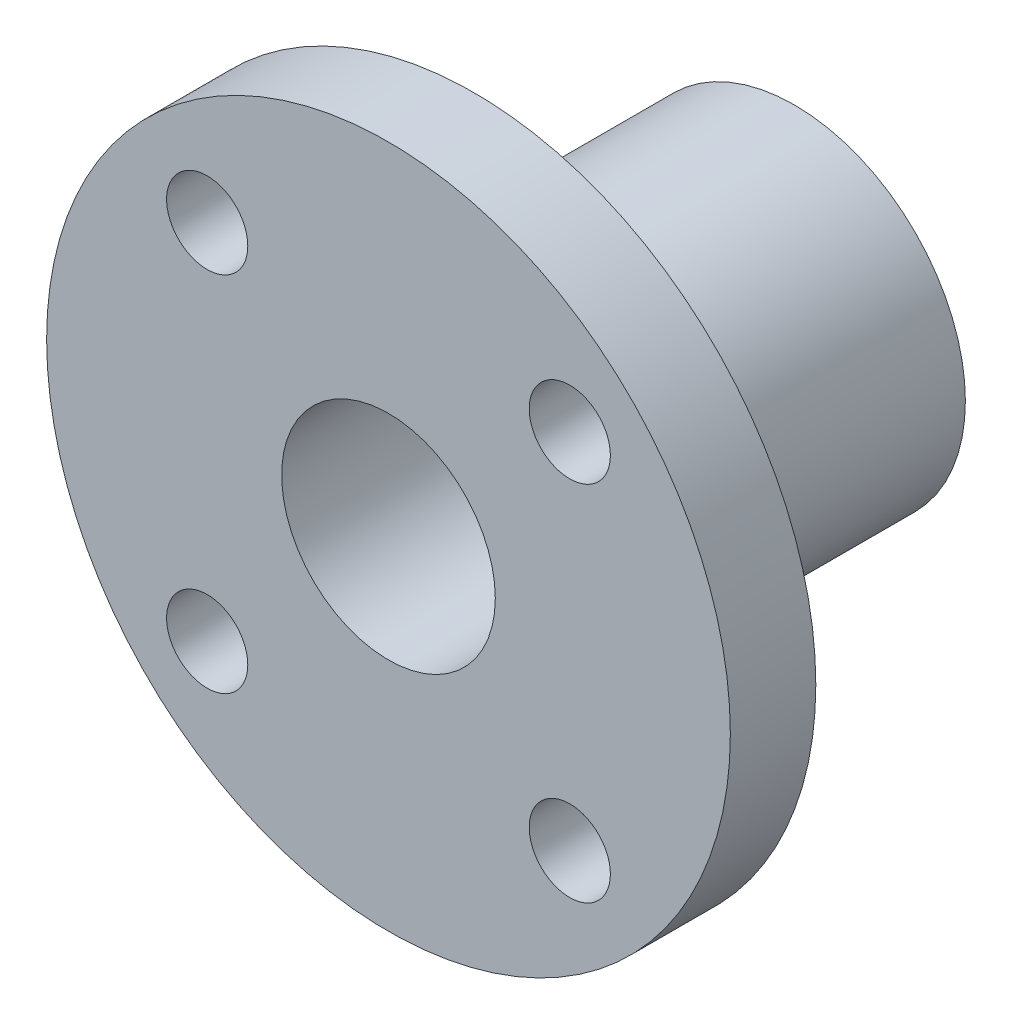
ISO-10303-21;
HEADER;
FILE_DESCRIPTION(('STEP AP214'),'2;1');
FILE_NAME('part.step','',(''),(''),'','','');
FILE_SCHEMA(('AUTOMOTIVE_DESIGN { 1 0 10303 214 1 1 1 1 }'));
ENDSEC;
DATA;
#1=APPLICATION_CONTEXT('core data for automotive mechanical design processes');
#2=APPLICATION_PROTOCOL_DEFINITION('international standard','automotive_design',2000,#1);
#3=PRODUCT_CONTEXT('',#1,'mechanical');
#4=PRODUCT('Part','Part','',(#3));
#5=PRODUCT_RELATED_PRODUCT_CATEGORY('part','',(#4));
#6=PRODUCT_DEFINITION_FORMATION('','',#4);
#7=PRODUCT_DEFINITION_CONTEXT('part definition',#1,'design');
#8=PRODUCT_DEFINITION('design','',#6,#7);
#9=PRODUCT_DEFINITION_SHAPE('','',#8);
#10=(LENGTH_UNIT() NAMED_UNIT(*) SI_UNIT(.MILLI.,.METRE.));
#11=(NAMED_UNIT(*) PLANE_ANGLE_UNIT() SI_UNIT($,.RADIAN.));
#12=(NAMED_UNIT(*) SI_UNIT($,.STERADIAN.) SOLID_ANGLE_UNIT());
#13=UNCERTAINTY_MEASURE_WITH_UNIT(LENGTH_MEASURE(1.E-05),#10,'distance_accuracy_value','');
#14=(GEOMETRIC_REPRESENTATION_CONTEXT(3) GLOBAL_UNCERTAINTY_ASSIGNED_CONTEXT((#13)) GLOBAL_UNIT_ASSIGNED_CONTEXT((#10,
#11,#12)) REPRESENTATION_CONTEXT('',''));
#15=CARTESIAN_POINT('',(0.,0.,0.));
#16=DIRECTION('',(0.,0.,1.));
#17=DIRECTION('',(1.,0.,0.));
#18=AXIS2_PLACEMENT_3D('',#15,#16,#17);
#19=CARTESIAN_POINT('',(0.,0.,0.));
#20=DIRECTION('',(0.,0.,1.));
#21=DIRECTION('',(1.,0.,0.));
#22=AXIS2_PLACEMENT_3D('',#19,#20,#21);
#23=PLANE('',#22);
#24=CARTESIAN_POINT('',(0.,0.,0.));
#25=DIRECTION('',(0.,0.,1.));
#26=DIRECTION('',(1.,0.,0.));
#27=AXIS2_PLACEMENT_3D('',#24,#25,#26);
#28=CIRCLE('',#27,8.);
#29=CARTESIAN_POINT('',(8.,0.,0.));
#30=VERTEX_POINT('',#29);
#31=EDGE_CURVE('E37',#30,#30,#28,.T.);
#32=ORIENTED_EDGE('',*,*,#31,.F.);
#33=EDGE_LOOP('',(#32));
#34=FACE_BOUND('',#33,.T.);
#35=CARTESIAN_POINT('',(0.,0.,0.));
#36=DIRECTION('',(0.,0.,1.));
#37=DIRECTION('',(1.,0.,0.));
#38=AXIS2_PLACEMENT_3D('',#35,#36,#37);
#39=CIRCLE('',#38,5.);
#40=CARTESIAN_POINT('',(5.,0.,0.));
#41=VERTEX_POINT('',#40);
#42=EDGE_CURVE('E44',#41,#41,#39,.T.);
#43=ORIENTED_EDGE('',*,*,#42,.T.);
#44=EDGE_LOOP('',(#43));
#45=FACE_BOUND('',#44,.T.);
#46=ADVANCED_FACE('F33',(#34,#45),#23,.F.);
#47=CARTESIAN_POINT('',(0.,0.,15.));
#48=DIRECTION('',(0.,0.,-1.));
#49=DIRECTION('',(-1.,0.,0.));
#50=AXIS2_PLACEMENT_3D('',#47,#48,#49);
#51=CYLINDRICAL_SURFACE('',#50,8.);
#52=CARTESIAN_POINT('',(0.,0.,15.));
#53=DIRECTION('',(0.,0.,1.));
#54=DIRECTION('',(1.,0.,0.));
#55=AXIS2_PLACEMENT_3D('',#52,#53,#54);
#56=CIRCLE('',#55,8.);
#57=CARTESIAN_POINT('',(8.,0.,15.));
#58=VERTEX_POINT('',#57);
#59=EDGE_CURVE('E10',#58,#58,#56,.T.);
#60=ORIENTED_EDGE('',*,*,#59,.F.);
#61=EDGE_LOOP('',(#60));
#62=FACE_BOUND('',#61,.T.);
#63=ORIENTED_EDGE('',*,*,#31,.T.);
#64=EDGE_LOOP('',(#63));
#65=FACE_BOUND('',#64,.T.);
#66=ADVANCED_FACE('F35',(#62,#65),#51,.T.);
#67=CARTESIAN_POINT('',(0.,0.,15.));
#68=DIRECTION('',(0.,0.,-1.));
#69=DIRECTION('',(-1.,0.,0.));
#70=AXIS2_PLACEMENT_3D('',#67,#68,#69);
#71=CYLINDRICAL_SURFACE('',#70,5.);
#72=ORIENTED_EDGE('',*,*,#42,.F.);
#73=EDGE_LOOP('',(#72));
#74=FACE_BOUND('',#73,.T.);
#75=CARTESIAN_POINT('',(0.,0.,19.));
#76=DIRECTION('',(0.,0.,1.));
#77=DIRECTION('',(1.,0.,0.));
#78=AXIS2_PLACEMENT_3D('',#75,#76,#77);
#79=CIRCLE('',#78,5.);
#80=CARTESIAN_POINT('',(5.,0.,19.));
#81=VERTEX_POINT('',#80);
#82=EDGE_CURVE('E52',#81,#81,#79,.T.);
#83=ORIENTED_EDGE('',*,*,#82,.T.);
#84=EDGE_LOOP('',(#83));
#85=FACE_BOUND('',#84,.T.);
#86=ADVANCED_FACE('F88',(#74,#85),#71,.F.);
#87=CARTESIAN_POINT('',(0.,0.,19.));
#88=DIRECTION('',(0.,0.,1.));
#89=DIRECTION('',(1.,0.,0.));
#90=AXIS2_PLACEMENT_3D('',#87,#88,#89);
#91=PLANE('',#90);
#92=CARTESIAN_POINT('',(-8.48528137423857,-8.48528137423857,19.));
#93=DIRECTION('',(0.,0.,1.));
#94=DIRECTION('',(1.,0.,0.));
#95=AXIS2_PLACEMENT_3D('',#92,#93,#94);
#96=CIRCLE('',#95,1.9);
#97=CARTESIAN_POINT('',(-6.58528137423857,-8.48528137423857,19.));
#98=VERTEX_POINT('',#97);
#99=EDGE_CURVE('E67',#98,#98,#96,.T.);
#100=ORIENTED_EDGE('',*,*,#99,.F.);
#101=EDGE_LOOP('',(#100));
#102=FACE_BOUND('',#101,.T.);
#103=CARTESIAN_POINT('',(-8.48528137423857,8.48528137423857,19.));
#104=DIRECTION('',(0.,0.,1.));
#105=DIRECTION('',(1.,0.,0.));
#106=AXIS2_PLACEMENT_3D('',#103,#104,#105);
#107=CIRCLE('',#106,1.9);
#108=CARTESIAN_POINT('',(-6.58528137423857,8.48528137423857,19.));
#109=VERTEX_POINT('',#108);
#110=EDGE_CURVE('E57',#109,#109,#107,.T.);
#111=ORIENTED_EDGE('',*,*,#110,.F.);
#112=EDGE_LOOP('',(#111));
#113=FACE_BOUND('',#112,.T.);
#114=CARTESIAN_POINT('',(0.,0.,19.));
#115=DIRECTION('',(0.,0.,1.));
#116=DIRECTION('',(1.,0.,0.));
#117=AXIS2_PLACEMENT_3D('',#114,#115,#116);
#118=CIRCLE('',#117,16.);
#119=CARTESIAN_POINT('',(16.,0.,19.));
#120=VERTEX_POINT('',#119);
#121=EDGE_CURVE('E48',#120,#120,#118,.T.);
#122=ORIENTED_EDGE('',*,*,#121,.T.);
#123=EDGE_LOOP('',(#122));
#124=FACE_BOUND('',#123,.T.);
#125=ORIENTED_EDGE('',*,*,#82,.F.);
#126=EDGE_LOOP('',(#125));
#127=FACE_BOUND('',#126,.T.);
#128=CARTESIAN_POINT('',(8.48528137423857,8.48528137423857,19.));
#129=DIRECTION('',(0.,0.,1.));
#130=DIRECTION('',(1.,0.,0.));
#131=AXIS2_PLACEMENT_3D('',#128,#129,#130);
#132=CIRCLE('',#131,1.9);
#133=CARTESIAN_POINT('',(10.3852813742386,8.48528137423857,19.));
#134=VERTEX_POINT('',#133);
#135=EDGE_CURVE('E61',#134,#134,#132,.T.);
#136=ORIENTED_EDGE('',*,*,#135,.F.);
#137=EDGE_LOOP('',(#136));
#138=FACE_BOUND('',#137,.T.);
#139=CARTESIAN_POINT('',(8.48528137423857,-8.48528137423857,19.));
#140=DIRECTION('',(0.,0.,1.));
#141=DIRECTION('',(1.,0.,0.));
#142=AXIS2_PLACEMENT_3D('',#139,#140,#141);
#143=CIRCLE('',#142,1.9);
#144=CARTESIAN_POINT('',(10.3852813742386,-8.48528137423857,19.));
#145=VERTEX_POINT('',#144);
#146=EDGE_CURVE('E73',#145,#145,#143,.T.);
#147=ORIENTED_EDGE('',*,*,#146,.F.);
#148=EDGE_LOOP('',(#147));
#149=FACE_BOUND('',#148,.T.);
#150=ADVANCED_FACE('F85',(#102,#113,#124,#127,#138,#149),#91,.T.);
#151=CARTESIAN_POINT('',(0.,0.,15.));
#152=DIRECTION('',(0.,0.,1.));
#153=DIRECTION('',(1.,0.,0.));
#154=AXIS2_PLACEMENT_3D('',#151,#152,#153);
#155=PLANE('',#154);
#156=ORIENTED_EDGE('',*,*,#59,.T.);
#157=EDGE_LOOP('',(#156));
#158=FACE_BOUND('',#157,.T.);
#159=CARTESIAN_POINT('',(0.,0.,15.));
#160=DIRECTION('',(0.,0.,1.));
#161=DIRECTION('',(1.,0.,0.));
#162=AXIS2_PLACEMENT_3D('',#159,#160,#161);
#163=CIRCLE('',#162,16.);
#164=CARTESIAN_POINT('',(16.,0.,15.));
#165=VERTEX_POINT('',#164);
#166=EDGE_CURVE('E49',#165,#165,#163,.T.);
#167=ORIENTED_EDGE('',*,*,#166,.F.);
#168=EDGE_LOOP('',(#167));
#169=FACE_BOUND('',#168,.T.);
#170=CARTESIAN_POINT('',(-8.48528137423857,8.48528137423857,15.));
#171=DIRECTION('',(0.,0.,1.));
#172=DIRECTION('',(1.,0.,0.));
#173=AXIS2_PLACEMENT_3D('',#170,#171,#172);
#174=CIRCLE('',#173,1.9);
#175=CARTESIAN_POINT('',(-6.58528137423857,8.48528137423857,15.));
#176=VERTEX_POINT('',#175);
#177=EDGE_CURVE('E58',#176,#176,#174,.T.);
#178=ORIENTED_EDGE('',*,*,#177,.T.);
#179=EDGE_LOOP('',(#178));
#180=FACE_BOUND('',#179,.T.);
#181=CARTESIAN_POINT('',(8.48528137423857,8.48528137423857,15.));
#182=DIRECTION('',(0.,0.,1.));
#183=DIRECTION('',(1.,0.,0.));
#184=AXIS2_PLACEMENT_3D('',#181,#182,#183);
#185=CIRCLE('',#184,1.9);
#186=CARTESIAN_POINT('',(10.3852813742386,8.48528137423857,15.));
#187=VERTEX_POINT('',#186);
#188=EDGE_CURVE('E64',#187,#187,#185,.T.);
#189=ORIENTED_EDGE('',*,*,#188,.T.);
#190=EDGE_LOOP('',(#189));
#191=FACE_BOUND('',#190,.T.);
#192=CARTESIAN_POINT('',(-8.48528137423857,-8.48528137423857,15.));
#193=DIRECTION('',(0.,0.,1.));
#194=DIRECTION('',(1.,0.,0.));
#195=AXIS2_PLACEMENT_3D('',#192,#193,#194);
#196=CIRCLE('',#195,1.9);
#197=CARTESIAN_POINT('',(-6.58528137423857,-8.48528137423857,15.));
#198=VERTEX_POINT('',#197);
#199=EDGE_CURVE('E70',#198,#198,#196,.T.);
#200=ORIENTED_EDGE('',*,*,#199,.T.);
#201=EDGE_LOOP('',(#200));
#202=FACE_BOUND('',#201,.T.);
#203=CARTESIAN_POINT('',(8.48528137423857,-8.48528137423857,15.));
#204=DIRECTION('',(0.,0.,1.));
#205=DIRECTION('',(1.,0.,0.));
#206=AXIS2_PLACEMENT_3D('',#203,#204,#205);
#207=CIRCLE('',#206,1.9);
#208=CARTESIAN_POINT('',(10.3852813742386,-8.48528137423857,15.));
#209=VERTEX_POINT('',#208);
#210=EDGE_CURVE('E76',#209,#209,#207,.T.);
#211=ORIENTED_EDGE('',*,*,#210,.T.);
#212=EDGE_LOOP('',(#211));
#213=FACE_BOUND('',#212,.T.);
#214=ADVANCED_FACE('F87',(#158,#169,#180,#191,#202,#213),#155,.F.);
#215=CARTESIAN_POINT('',(0.,0.,19.));
#216=DIRECTION('',(0.,0.,-1.));
#217=DIRECTION('',(-1.,0.,0.));
#218=AXIS2_PLACEMENT_3D('',#215,#216,#217);
#219=CYLINDRICAL_SURFACE('',#218,16.);
#220=ORIENTED_EDGE('',*,*,#121,.F.);
#221=EDGE_LOOP('',(#220));
#222=FACE_BOUND('',#221,.T.);
#223=ORIENTED_EDGE('',*,*,#166,.T.);
#224=EDGE_LOOP('',(#223));
#225=FACE_BOUND('',#224,.T.);
#226=ADVANCED_FACE('F95',(#222,#225),#219,.T.);
#227=CARTESIAN_POINT('',(-8.48528137423857,8.48528137423857,19.));
#228=DIRECTION('',(0.,0.,-1.));
#229=DIRECTION('',(-1.,0.,0.));
#230=AXIS2_PLACEMENT_3D('',#227,#228,#229);
#231=CYLINDRICAL_SURFACE('',#230,1.9);
#232=ORIENTED_EDGE('',*,*,#110,.T.);
#233=EDGE_LOOP('',(#232));
#234=FACE_BOUND('',#233,.T.);
#235=ORIENTED_EDGE('',*,*,#177,.F.);
#236=EDGE_LOOP('',(#235));
#237=FACE_BOUND('',#236,.T.);
#238=ADVANCED_FACE('F112',(#234,#237),#231,.F.);
#239=CARTESIAN_POINT('',(8.48528137423857,8.48528137423857,19.));
#240=DIRECTION('',(0.,0.,-1.));
#241=DIRECTION('',(-1.,0.,0.));
#242=AXIS2_PLACEMENT_3D('',#239,#240,#241);
#243=CYLINDRICAL_SURFACE('',#242,1.9);
#244=ORIENTED_EDGE('',*,*,#135,.T.);
#245=EDGE_LOOP('',(#244));
#246=FACE_BOUND('',#245,.T.);
#247=ORIENTED_EDGE('',*,*,#188,.F.);
#248=EDGE_LOOP('',(#247));
#249=FACE_BOUND('',#248,.T.);
#250=ADVANCED_FACE('F117',(#246,#249),#243,.F.);
#251=CARTESIAN_POINT('',(-8.48528137423857,-8.48528137423857,19.));
#252=DIRECTION('',(0.,0.,-1.));
#253=DIRECTION('',(-1.,0.,0.));
#254=AXIS2_PLACEMENT_3D('',#251,#252,#253);
#255=CYLINDRICAL_SURFACE('',#254,1.9);
#256=ORIENTED_EDGE('',*,*,#99,.T.);
#257=EDGE_LOOP('',(#256));
#258=FACE_BOUND('',#257,.T.);
#259=ORIENTED_EDGE('',*,*,#199,.F.);
#260=EDGE_LOOP('',(#259));
#261=FACE_BOUND('',#260,.T.);
#262=ADVANCED_FACE('F132',(#258,#261),#255,.F.);
#263=CARTESIAN_POINT('',(8.48528137423857,-8.48528137423857,19.));
#264=DIRECTION('',(0.,0.,-1.));
#265=DIRECTION('',(-1.,0.,0.));
#266=AXIS2_PLACEMENT_3D('',#263,#264,#265);
#267=CYLINDRICAL_SURFACE('',#266,1.9);
#268=ORIENTED_EDGE('',*,*,#146,.T.);
#269=EDGE_LOOP('',(#268));
#270=FACE_BOUND('',#269,.T.);
#271=ORIENTED_EDGE('',*,*,#210,.F.);
#272=EDGE_LOOP('',(#271));
#273=FACE_BOUND('',#272,.T.);
#274=ADVANCED_FACE('F82',(#270,#273),#267,.F.);
#275=CLOSED_SHELL('',(#46,#66,#86,#150,#214,#226,#238,#250,#262,#274));
#276=MANIFOLD_SOLID_BREP('B2',#275);
#277=ADVANCED_BREP_SHAPE_REPRESENTATION('',(#18,#276),#14);
#278=SHAPE_DEFINITION_REPRESENTATION(#9,#277);
ENDSEC;
END-ISO-10303-21;
